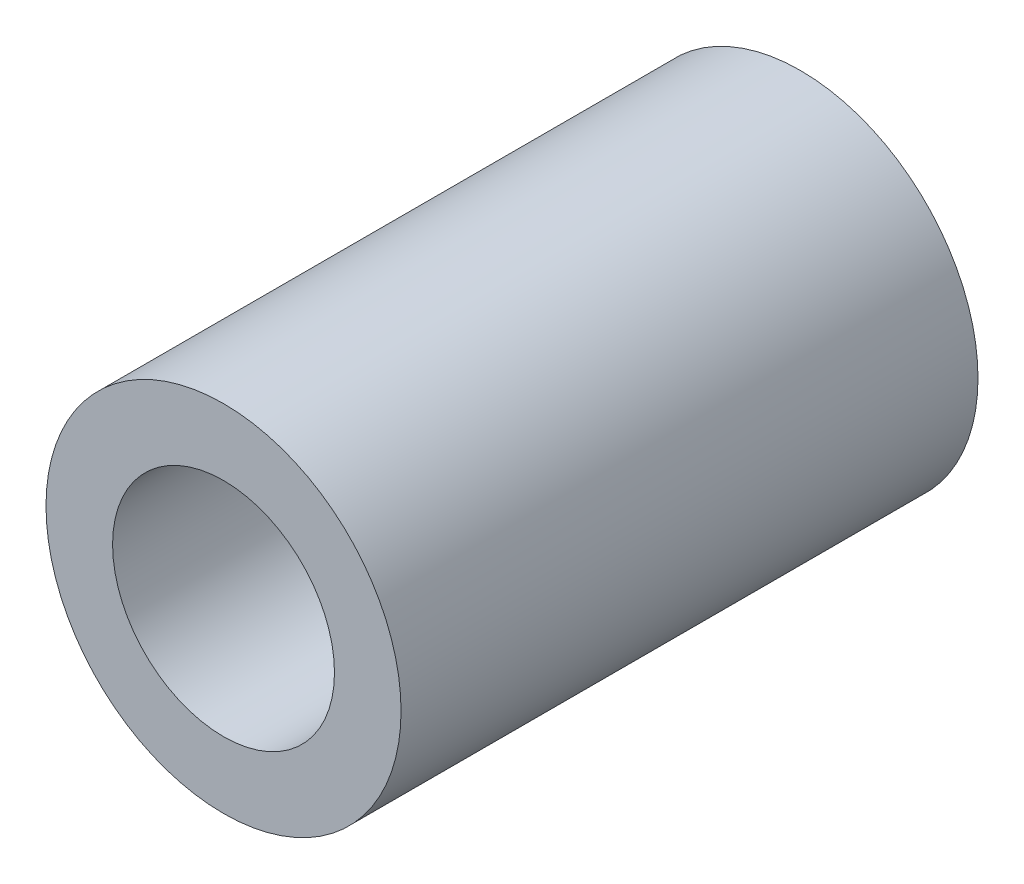
ISO-10303-21;
HEADER;
FILE_DESCRIPTION(('STEP AP214'),'2;1');
FILE_NAME('part.step','',(''),(''),'','','');
FILE_SCHEMA(('AUTOMOTIVE_DESIGN { 1 0 10303 214 1 1 1 1 }'));
ENDSEC;
DATA;
#1=APPLICATION_CONTEXT('core data for automotive mechanical design processes');
#2=APPLICATION_PROTOCOL_DEFINITION('international standard','automotive_design',2000,#1);
#3=PRODUCT_CONTEXT('',#1,'mechanical');
#4=PRODUCT('Part','Part','',(#3));
#5=PRODUCT_RELATED_PRODUCT_CATEGORY('part','',(#4));
#6=PRODUCT_DEFINITION_FORMATION('','',#4);
#7=PRODUCT_DEFINITION_CONTEXT('part definition',#1,'design');
#8=PRODUCT_DEFINITION('design','',#6,#7);
#9=PRODUCT_DEFINITION_SHAPE('','',#8);
#10=(LENGTH_UNIT() NAMED_UNIT(*) SI_UNIT(.MILLI.,.METRE.));
#11=(NAMED_UNIT(*) PLANE_ANGLE_UNIT() SI_UNIT($,.RADIAN.));
#12=(NAMED_UNIT(*) SI_UNIT($,.STERADIAN.) SOLID_ANGLE_UNIT());
#13=UNCERTAINTY_MEASURE_WITH_UNIT(LENGTH_MEASURE(1.E-05),#10,'distance_accuracy_value','');
#14=(GEOMETRIC_REPRESENTATION_CONTEXT(3) GLOBAL_UNCERTAINTY_ASSIGNED_CONTEXT((#13)) GLOBAL_UNIT_ASSIGNED_CONTEXT((#10,
#11,#12)) REPRESENTATION_CONTEXT('',''));
#15=CARTESIAN_POINT('',(0.,0.,0.));
#16=DIRECTION('',(0.,0.,1.));
#17=DIRECTION('',(1.,0.,0.));
#18=AXIS2_PLACEMENT_3D('',#15,#16,#17);
#19=CARTESIAN_POINT('',(0.,0.,-13.));
#20=DIRECTION('',(0.,0.,1.));
#21=DIRECTION('',(1.,0.,0.));
#22=AXIS2_PLACEMENT_3D('',#19,#20,#21);
#23=CYLINDRICAL_SURFACE('',#22,4.);
#24=CARTESIAN_POINT('',(0.,0.,-13.));
#25=DIRECTION('',(0.,0.,1.));
#26=DIRECTION('',(1.,0.,0.));
#27=AXIS2_PLACEMENT_3D('',#24,#25,#26);
#28=CIRCLE('',#27,4.);
#29=CARTESIAN_POINT('',(4.,0.,-13.));
#30=VERTEX_POINT('',#29);
#31=EDGE_CURVE('E10',#30,#30,#28,.T.);
#32=ORIENTED_EDGE('',*,*,#31,.T.);
#33=EDGE_LOOP('',(#32));
#34=FACE_BOUND('',#33,.T.);
#35=CARTESIAN_POINT('',(0.,0.,0.));
#36=DIRECTION('',(0.,0.,1.));
#37=DIRECTION('',(1.,0.,0.));
#38=AXIS2_PLACEMENT_3D('',#35,#36,#37);
#39=CIRCLE('',#38,4.);
#40=CARTESIAN_POINT('',(4.,0.,0.));
#41=VERTEX_POINT('',#40);
#42=EDGE_CURVE('E33',#41,#41,#39,.T.);
#43=ORIENTED_EDGE('',*,*,#42,.F.);
#44=EDGE_LOOP('',(#43));
#45=FACE_BOUND('',#44,.T.);
#46=ADVANCED_FACE('F30',(#34,#45),#23,.T.);
#47=CARTESIAN_POINT('',(0.,0.,-13.));
#48=DIRECTION('',(0.,0.,1.));
#49=DIRECTION('',(1.,0.,0.));
#50=AXIS2_PLACEMENT_3D('',#47,#48,#49);
#51=PLANE('',#50);
#52=CARTESIAN_POINT('',(0.,0.,-13.));
#53=DIRECTION('',(0.,0.,1.));
#54=DIRECTION('',(1.,0.,0.));
#55=AXIS2_PLACEMENT_3D('',#52,#53,#54);
#56=CIRCLE('',#55,2.5);
#57=CARTESIAN_POINT('',(2.5,0.,-13.));
#58=VERTEX_POINT('',#57);
#59=EDGE_CURVE('E40',#58,#58,#56,.T.);
#60=ORIENTED_EDGE('',*,*,#59,.T.);
#61=EDGE_LOOP('',(#60));
#62=FACE_BOUND('',#61,.T.);
#63=ORIENTED_EDGE('',*,*,#31,.F.);
#64=EDGE_LOOP('',(#63));
#65=FACE_BOUND('',#64,.T.);
#66=ADVANCED_FACE('F48',(#62,#65),#51,.F.);
#67=CARTESIAN_POINT('',(0.,0.,0.));
#68=DIRECTION('',(0.,0.,1.));
#69=DIRECTION('',(1.,0.,0.));
#70=AXIS2_PLACEMENT_3D('',#67,#68,#69);
#71=PLANE('',#70);
#72=CARTESIAN_POINT('',(0.,0.,0.));
#73=DIRECTION('',(0.,0.,1.));
#74=DIRECTION('',(1.,0.,0.));
#75=AXIS2_PLACEMENT_3D('',#72,#73,#74);
#76=CIRCLE('',#75,2.5);
#77=CARTESIAN_POINT('',(2.5,0.,0.));
#78=VERTEX_POINT('',#77);
#79=EDGE_CURVE('E42',#78,#78,#76,.T.);
#80=ORIENTED_EDGE('',*,*,#79,.F.);
#81=EDGE_LOOP('',(#80));
#82=FACE_BOUND('',#81,.T.);
#83=ORIENTED_EDGE('',*,*,#42,.T.);
#84=EDGE_LOOP('',(#83));
#85=FACE_BOUND('',#84,.T.);
#86=ADVANCED_FACE('F54',(#82,#85),#71,.T.);
#87=CARTESIAN_POINT('',(0.,0.,-13.));
#88=DIRECTION('',(0.,0.,1.));
#89=DIRECTION('',(1.,0.,0.));
#90=AXIS2_PLACEMENT_3D('',#87,#88,#89);
#91=CYLINDRICAL_SURFACE('',#90,2.5);
#92=ORIENTED_EDGE('',*,*,#59,.F.);
#93=EDGE_LOOP('',(#92));
#94=FACE_BOUND('',#93,.T.);
#95=ORIENTED_EDGE('',*,*,#79,.T.);
#96=EDGE_LOOP('',(#95));
#97=FACE_BOUND('',#96,.T.);
#98=ADVANCED_FACE('F51',(#94,#97),#91,.F.);
#99=CLOSED_SHELL('',(#46,#66,#86,#98));
#100=MANIFOLD_SOLID_BREP('B2',#99);
#101=ADVANCED_BREP_SHAPE_REPRESENTATION('',(#18,#100),#14);
#102=SHAPE_DEFINITION_REPRESENTATION(#9,#101);
ENDSEC;
END-ISO-10303-21;
